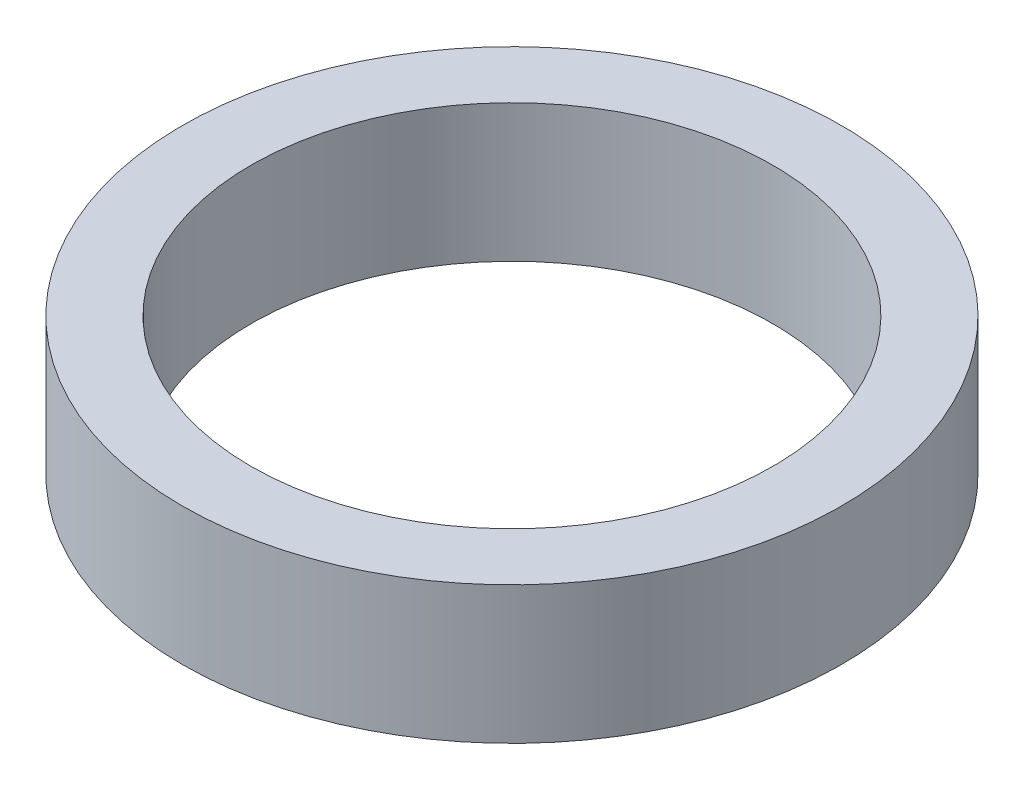
ISO-10303-21;
HEADER;
FILE_DESCRIPTION(('STEP AP214'),'2;1');
FILE_NAME('part.step','',(''),(''),'','','');
FILE_SCHEMA(('AUTOMOTIVE_DESIGN { 1 0 10303 214 1 1 1 1 }'));
ENDSEC;
DATA;
#1=APPLICATION_CONTEXT('core data for automotive mechanical design processes');
#2=APPLICATION_PROTOCOL_DEFINITION('international standard','automotive_design',2000,#1);
#3=PRODUCT_CONTEXT('',#1,'mechanical');
#4=PRODUCT('Part','Part','',(#3));
#5=PRODUCT_RELATED_PRODUCT_CATEGORY('part','',(#4));
#6=PRODUCT_DEFINITION_FORMATION('','',#4);
#7=PRODUCT_DEFINITION_CONTEXT('part definition',#1,'design');
#8=PRODUCT_DEFINITION('design','',#6,#7);
#9=PRODUCT_DEFINITION_SHAPE('','',#8);
#10=(LENGTH_UNIT() NAMED_UNIT(*) SI_UNIT(.MILLI.,.METRE.));
#11=(NAMED_UNIT(*) PLANE_ANGLE_UNIT() SI_UNIT($,.RADIAN.));
#12=(NAMED_UNIT(*) SI_UNIT($,.STERADIAN.) SOLID_ANGLE_UNIT());
#13=UNCERTAINTY_MEASURE_WITH_UNIT(LENGTH_MEASURE(1.E-05),#10,'distance_accuracy_value','');
#14=(GEOMETRIC_REPRESENTATION_CONTEXT(3) GLOBAL_UNCERTAINTY_ASSIGNED_CONTEXT((#13)) GLOBAL_UNIT_ASSIGNED_CONTEXT((#10,
#11,#12)) REPRESENTATION_CONTEXT('',''));
#15=CARTESIAN_POINT('',(0.,0.,0.));
#16=DIRECTION('',(0.,0.,1.));
#17=DIRECTION('',(1.,0.,0.));
#18=AXIS2_PLACEMENT_3D('',#15,#16,#17);
#19=CARTESIAN_POINT('',(0.,25.,0.));
#20=DIRECTION('',(0.,-1.,0.));
#21=DIRECTION('',(0.,0.,-1.));
#22=AXIS2_PLACEMENT_3D('',#19,#20,#21);
#23=CYLINDRICAL_SURFACE('',#22,60.);
#24=CARTESIAN_POINT('',(0.,25.,0.));
#25=DIRECTION('',(0.,1.,0.));
#26=DIRECTION('',(0.,0.,1.));
#27=AXIS2_PLACEMENT_3D('',#24,#25,#26);
#28=CIRCLE('',#27,60.);
#29=CARTESIAN_POINT('',(0.,25.,60.));
#30=VERTEX_POINT('',#29);
#31=EDGE_CURVE('E10',#30,#30,#28,.T.);
#32=ORIENTED_EDGE('',*,*,#31,.F.);
#33=EDGE_LOOP('',(#32));
#34=FACE_BOUND('',#33,.T.);
#35=CARTESIAN_POINT('',(0.,0.,0.));
#36=DIRECTION('',(0.,1.,0.));
#37=DIRECTION('',(0.,0.,1.));
#38=AXIS2_PLACEMENT_3D('',#35,#36,#37);
#39=CIRCLE('',#38,60.);
#40=CARTESIAN_POINT('',(0.,0.,60.));
#41=VERTEX_POINT('',#40);
#42=EDGE_CURVE('E37',#41,#41,#39,.T.);
#43=ORIENTED_EDGE('',*,*,#42,.T.);
#44=EDGE_LOOP('',(#43));
#45=FACE_BOUND('',#44,.T.);
#46=ADVANCED_FACE('F40',(#34,#45),#23,.T.);
#47=CARTESIAN_POINT('',(0.,25.,0.));
#48=DIRECTION('',(0.,1.,0.));
#49=DIRECTION('',(0.,0.,1.));
#50=AXIS2_PLACEMENT_3D('',#47,#48,#49);
#51=PLANE('',#50);
#52=CARTESIAN_POINT('',(0.,25.,0.));
#53=DIRECTION('',(0.,1.,0.));
#54=DIRECTION('',(0.,0.,1.));
#55=AXIS2_PLACEMENT_3D('',#52,#53,#54);
#56=CIRCLE('',#55,47.5);
#57=CARTESIAN_POINT('',(0.,25.,47.5));
#58=VERTEX_POINT('',#57);
#59=EDGE_CURVE('E50',#58,#58,#56,.T.);
#60=ORIENTED_EDGE('',*,*,#59,.F.);
#61=EDGE_LOOP('',(#60));
#62=FACE_BOUND('',#61,.T.);
#63=ORIENTED_EDGE('',*,*,#31,.T.);
#64=EDGE_LOOP('',(#63));
#65=FACE_BOUND('',#64,.T.);
#66=ADVANCED_FACE('F59',(#62,#65),#51,.T.);
#67=CARTESIAN_POINT('',(0.,0.,0.));
#68=DIRECTION('',(0.,1.,0.));
#69=DIRECTION('',(0.,0.,1.));
#70=AXIS2_PLACEMENT_3D('',#67,#68,#69);
#71=PLANE('',#70);
#72=CARTESIAN_POINT('',(0.,0.,0.));
#73=DIRECTION('',(0.,1.,0.));
#74=DIRECTION('',(0.,0.,1.));
#75=AXIS2_PLACEMENT_3D('',#72,#73,#74);
#76=CIRCLE('',#75,47.5);
#77=CARTESIAN_POINT('',(0.,0.,47.5));
#78=VERTEX_POINT('',#77);
#79=EDGE_CURVE('E47',#78,#78,#76,.T.);
#80=ORIENTED_EDGE('',*,*,#79,.T.);
#81=EDGE_LOOP('',(#80));
#82=FACE_BOUND('',#81,.T.);
#83=ORIENTED_EDGE('',*,*,#42,.F.);
#84=EDGE_LOOP('',(#83));
#85=FACE_BOUND('',#84,.T.);
#86=ADVANCED_FACE('F58',(#82,#85),#71,.F.);
#87=CARTESIAN_POINT('',(0.,25.,0.));
#88=DIRECTION('',(0.,-1.,0.));
#89=DIRECTION('',(0.,0.,-1.));
#90=AXIS2_PLACEMENT_3D('',#87,#88,#89);
#91=CYLINDRICAL_SURFACE('',#90,47.5);
#92=ORIENTED_EDGE('',*,*,#59,.T.);
#93=EDGE_LOOP('',(#92));
#94=FACE_BOUND('',#93,.T.);
#95=ORIENTED_EDGE('',*,*,#79,.F.);
#96=EDGE_LOOP('',(#95));
#97=FACE_BOUND('',#96,.T.);
#98=ADVANCED_FACE('F54',(#94,#97),#91,.F.);
#99=CLOSED_SHELL('',(#46,#66,#86,#98));
#100=MANIFOLD_SOLID_BREP('B2',#99);
#101=ADVANCED_BREP_SHAPE_REPRESENTATION('',(#18,#100),#14);
#102=SHAPE_DEFINITION_REPRESENTATION(#9,#101);
ENDSEC;
END-ISO-10303-21;
